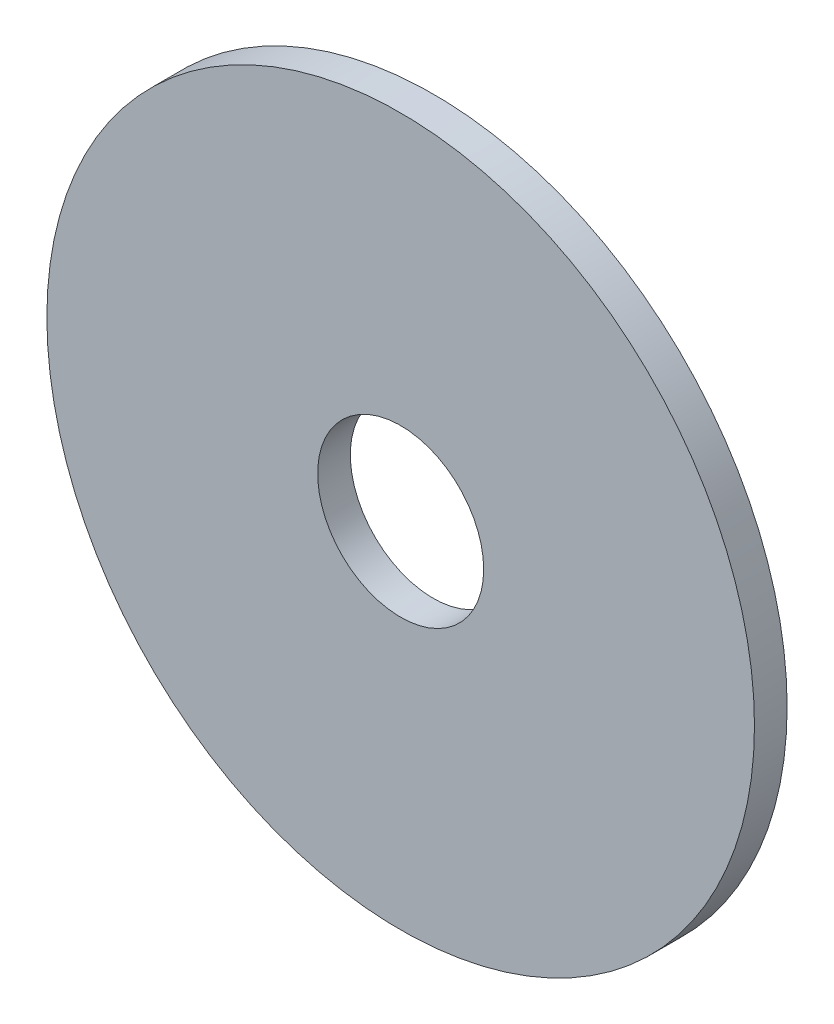
ISO-10303-21;
HEADER;
FILE_DESCRIPTION(('STEP AP214'),'2;1');
FILE_NAME('part.step','',(''),(''),'','','');
FILE_SCHEMA(('AUTOMOTIVE_DESIGN { 1 0 10303 214 1 1 1 1 }'));
ENDSEC;
DATA;
#1=APPLICATION_CONTEXT('core data for automotive mechanical design processes');
#2=APPLICATION_PROTOCOL_DEFINITION('international standard','automotive_design',2000,#1);
#3=PRODUCT_CONTEXT('',#1,'mechanical');
#4=PRODUCT('Part','Part','',(#3));
#5=PRODUCT_RELATED_PRODUCT_CATEGORY('part','',(#4));
#6=PRODUCT_DEFINITION_FORMATION('','',#4);
#7=PRODUCT_DEFINITION_CONTEXT('part definition',#1,'design');
#8=PRODUCT_DEFINITION('design','',#6,#7);
#9=PRODUCT_DEFINITION_SHAPE('','',#8);
#10=(LENGTH_UNIT() NAMED_UNIT(*) SI_UNIT(.MILLI.,.METRE.));
#11=(NAMED_UNIT(*) PLANE_ANGLE_UNIT() SI_UNIT($,.RADIAN.));
#12=(NAMED_UNIT(*) SI_UNIT($,.STERADIAN.) SOLID_ANGLE_UNIT());
#13=UNCERTAINTY_MEASURE_WITH_UNIT(LENGTH_MEASURE(1.E-05),#10,'distance_accuracy_value','');
#14=(GEOMETRIC_REPRESENTATION_CONTEXT(3) GLOBAL_UNCERTAINTY_ASSIGNED_CONTEXT((#13)) GLOBAL_UNIT_ASSIGNED_CONTEXT((#10,
#11,#12)) REPRESENTATION_CONTEXT('',''));
#15=CARTESIAN_POINT('',(0.,0.,0.));
#16=DIRECTION('',(0.,0.,1.));
#17=DIRECTION('',(1.,0.,0.));
#18=AXIS2_PLACEMENT_3D('',#15,#16,#17);
#19=CARTESIAN_POINT('',(0.,0.,6.));
#20=DIRECTION('',(0.,0.,-1.));
#21=DIRECTION('',(-1.,0.,0.));
#22=AXIS2_PLACEMENT_3D('',#19,#20,#21);
#23=CYLINDRICAL_SURFACE('',#22,65.);
#24=CARTESIAN_POINT('',(0.,0.,6.));
#25=DIRECTION('',(0.,0.,1.));
#26=DIRECTION('',(1.,0.,0.));
#27=AXIS2_PLACEMENT_3D('',#24,#25,#26);
#28=CIRCLE('',#27,65.);
#29=CARTESIAN_POINT('',(65.,0.,6.));
#30=VERTEX_POINT('',#29);
#31=EDGE_CURVE('E10',#30,#30,#28,.T.);
#32=ORIENTED_EDGE('',*,*,#31,.F.);
#33=EDGE_LOOP('',(#32));
#34=FACE_BOUND('',#33,.T.);
#35=CARTESIAN_POINT('',(0.,0.,0.));
#36=DIRECTION('',(0.,0.,1.));
#37=DIRECTION('',(1.,0.,0.));
#38=AXIS2_PLACEMENT_3D('',#35,#36,#37);
#39=CIRCLE('',#38,65.);
#40=CARTESIAN_POINT('',(65.,0.,0.));
#41=VERTEX_POINT('',#40);
#42=EDGE_CURVE('E33',#41,#41,#39,.T.);
#43=ORIENTED_EDGE('',*,*,#42,.T.);
#44=EDGE_LOOP('',(#43));
#45=FACE_BOUND('',#44,.T.);
#46=ADVANCED_FACE('F30',(#34,#45),#23,.T.);
#47=CARTESIAN_POINT('',(0.,0.,6.));
#48=DIRECTION('',(0.,0.,1.));
#49=DIRECTION('',(1.,0.,0.));
#50=AXIS2_PLACEMENT_3D('',#47,#48,#49);
#51=PLANE('',#50);
#52=CARTESIAN_POINT('',(0.,0.,6.));
#53=DIRECTION('',(0.,0.,1.));
#54=DIRECTION('',(1.,0.,0.));
#55=AXIS2_PLACEMENT_3D('',#52,#53,#54);
#56=CIRCLE('',#55,15.25);
#57=CARTESIAN_POINT('',(15.25,0.,6.));
#58=VERTEX_POINT('',#57);
#59=EDGE_CURVE('E42',#58,#58,#56,.T.);
#60=ORIENTED_EDGE('',*,*,#59,.F.);
#61=EDGE_LOOP('',(#60));
#62=FACE_BOUND('',#61,.T.);
#63=ORIENTED_EDGE('',*,*,#31,.T.);
#64=EDGE_LOOP('',(#63));
#65=FACE_BOUND('',#64,.T.);
#66=ADVANCED_FACE('F57',(#62,#65),#51,.T.);
#67=CARTESIAN_POINT('',(0.,0.,0.));
#68=DIRECTION('',(0.,0.,1.));
#69=DIRECTION('',(1.,0.,0.));
#70=AXIS2_PLACEMENT_3D('',#67,#68,#69);
#71=PLANE('',#70);
#72=CARTESIAN_POINT('',(0.,0.,0.));
#73=DIRECTION('',(0.,0.,1.));
#74=DIRECTION('',(1.,0.,0.));
#75=AXIS2_PLACEMENT_3D('',#72,#73,#74);
#76=CIRCLE('',#75,15.25);
#77=CARTESIAN_POINT('',(15.25,0.,0.));
#78=VERTEX_POINT('',#77);
#79=EDGE_CURVE('E40',#78,#78,#76,.T.);
#80=ORIENTED_EDGE('',*,*,#79,.T.);
#81=EDGE_LOOP('',(#80));
#82=FACE_BOUND('',#81,.T.);
#83=ORIENTED_EDGE('',*,*,#42,.F.);
#84=EDGE_LOOP('',(#83));
#85=FACE_BOUND('',#84,.T.);
#86=ADVANCED_FACE('F48',(#82,#85),#71,.F.);
#87=CARTESIAN_POINT('',(0.,0.,0.));
#88=DIRECTION('',(0.,0.,1.));
#89=DIRECTION('',(1.,0.,0.));
#90=AXIS2_PLACEMENT_3D('',#87,#88,#89);
#91=CYLINDRICAL_SURFACE('',#90,15.25);
#92=ORIENTED_EDGE('',*,*,#79,.F.);
#93=EDGE_LOOP('',(#92));
#94=FACE_BOUND('',#93,.T.);
#95=ORIENTED_EDGE('',*,*,#59,.T.);
#96=EDGE_LOOP('',(#95));
#97=FACE_BOUND('',#96,.T.);
#98=ADVANCED_FACE('F51',(#94,#97),#91,.F.);
#99=CLOSED_SHELL('',(#46,#66,#86,#98));
#100=MANIFOLD_SOLID_BREP('B2',#99);
#101=ADVANCED_BREP_SHAPE_REPRESENTATION('',(#18,#100),#14);
#102=SHAPE_DEFINITION_REPRESENTATION(#9,#101);
ENDSEC;
END-ISO-10303-21;
